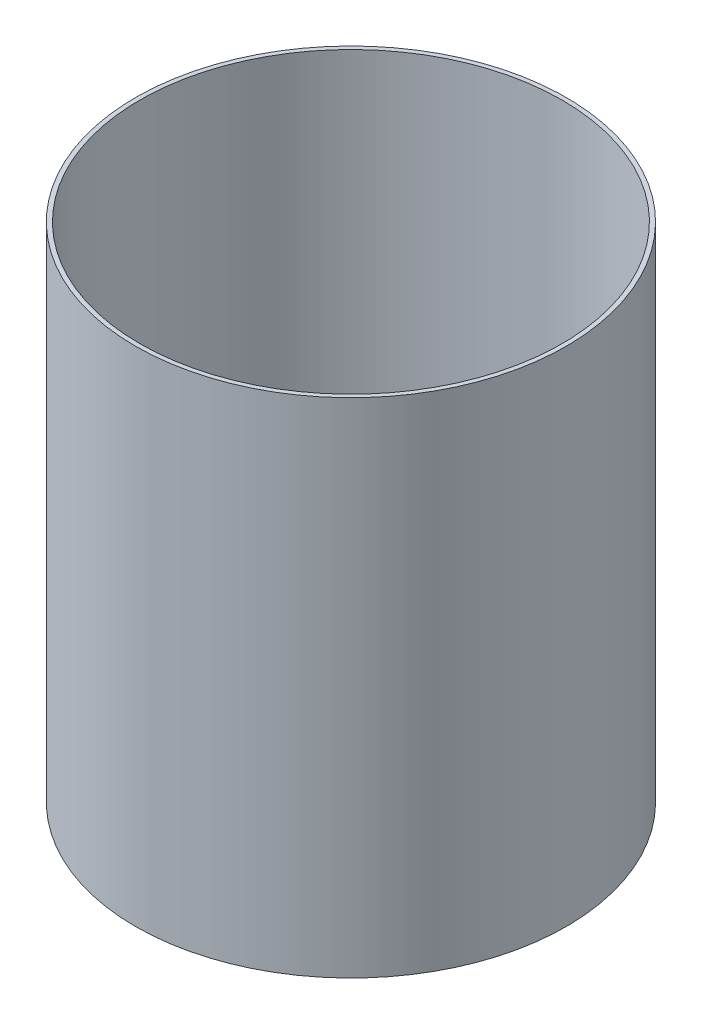
ISO-10303-21;
HEADER;
FILE_DESCRIPTION(('STEP AP214'),'2;1');
FILE_NAME('part.step','',(''),(''),'','','');
FILE_SCHEMA(('AUTOMOTIVE_DESIGN { 1 0 10303 214 1 1 1 1 }'));
ENDSEC;
DATA;
#1=APPLICATION_CONTEXT('core data for automotive mechanical design processes');
#2=APPLICATION_PROTOCOL_DEFINITION('international standard','automotive_design',2000,#1);
#3=PRODUCT_CONTEXT('',#1,'mechanical');
#4=PRODUCT('Part','Part','',(#3));
#5=PRODUCT_RELATED_PRODUCT_CATEGORY('part','',(#4));
#6=PRODUCT_DEFINITION_FORMATION('','',#4);
#7=PRODUCT_DEFINITION_CONTEXT('part definition',#1,'design');
#8=PRODUCT_DEFINITION('design','',#6,#7);
#9=PRODUCT_DEFINITION_SHAPE('','',#8);
#10=(LENGTH_UNIT() NAMED_UNIT(*) SI_UNIT(.MILLI.,.METRE.));
#11=(NAMED_UNIT(*) PLANE_ANGLE_UNIT() SI_UNIT($,.RADIAN.));
#12=(NAMED_UNIT(*) SI_UNIT($,.STERADIAN.) SOLID_ANGLE_UNIT());
#13=UNCERTAINTY_MEASURE_WITH_UNIT(LENGTH_MEASURE(1.E-05),#10,'distance_accuracy_value','');
#14=(GEOMETRIC_REPRESENTATION_CONTEXT(3) GLOBAL_UNCERTAINTY_ASSIGNED_CONTEXT((#13)) GLOBAL_UNIT_ASSIGNED_CONTEXT((#10,
#11,#12)) REPRESENTATION_CONTEXT('',''));
#15=CARTESIAN_POINT('',(0.,0.,0.));
#16=DIRECTION('',(0.,0.,1.));
#17=DIRECTION('',(1.,0.,0.));
#18=AXIS2_PLACEMENT_3D('',#15,#16,#17);
#19=CARTESIAN_POINT('',(0.,64.0981884057971,0.));
#20=DIRECTION('',(0.,1.,0.));
#21=DIRECTION('',(0.,0.,1.));
#22=AXIS2_PLACEMENT_3D('',#19,#20,#21);
#23=CYLINDRICAL_SURFACE('',#22,76.2);
#24=CARTESIAN_POINT('',(0.,-113.701811594203,0.));
#25=DIRECTION('',(0.,1.,0.));
#26=DIRECTION('',(0.,0.,1.));
#27=AXIS2_PLACEMENT_3D('',#24,#25,#26);
#28=CIRCLE('',#27,76.2);
#29=CARTESIAN_POINT('',(0.,-113.701811594203,76.2));
#30=VERTEX_POINT('',#29);
#31=EDGE_CURVE('E10',#30,#30,#28,.T.);
#32=ORIENTED_EDGE('',*,*,#31,.T.);
#33=EDGE_LOOP('',(#32));
#34=FACE_BOUND('',#33,.T.);
#35=CARTESIAN_POINT('',(0.,64.0981884057971,0.));
#36=DIRECTION('',(0.,1.,0.));
#37=DIRECTION('',(0.,0.,1.));
#38=AXIS2_PLACEMENT_3D('',#35,#36,#37);
#39=CIRCLE('',#38,76.2);
#40=CARTESIAN_POINT('',(0.,64.0981884057971,76.2));
#41=VERTEX_POINT('',#40);
#42=EDGE_CURVE('E45',#41,#41,#39,.T.);
#43=ORIENTED_EDGE('',*,*,#42,.F.);
#44=EDGE_LOOP('',(#43));
#45=FACE_BOUND('',#44,.T.);
#46=ADVANCED_FACE('F31',(#34,#45),#23,.T.);
#47=CARTESIAN_POINT('',(-76.2,-113.701811594203,0.));
#48=DIRECTION('',(0.,-1.,0.));
#49=DIRECTION('',(0.,0.,-1.));
#50=AXIS2_PLACEMENT_3D('',#47,#48,#49);
#51=PLANE('',#50);
#52=CARTESIAN_POINT('',(0.,-113.701811594203,0.));
#53=DIRECTION('',(0.,1.,0.));
#54=DIRECTION('',(0.,0.,1.));
#55=AXIS2_PLACEMENT_3D('',#52,#53,#54);
#56=CIRCLE('',#55,74.676);
#57=CARTESIAN_POINT('',(0.,-113.701811594203,74.676));
#58=VERTEX_POINT('',#57);
#59=EDGE_CURVE('E37',#58,#58,#56,.T.);
#60=ORIENTED_EDGE('',*,*,#59,.T.);
#61=EDGE_LOOP('',(#60));
#62=FACE_BOUND('',#61,.T.);
#63=ORIENTED_EDGE('',*,*,#31,.F.);
#64=EDGE_LOOP('',(#63));
#65=FACE_BOUND('',#64,.T.);
#66=ADVANCED_FACE('F55',(#62,#65),#51,.T.);
#67=CARTESIAN_POINT('',(0.,64.0981884057971,0.));
#68=DIRECTION('',(0.,1.,0.));
#69=DIRECTION('',(0.,0.,1.));
#70=AXIS2_PLACEMENT_3D('',#67,#68,#69);
#71=CYLINDRICAL_SURFACE('',#70,74.676);
#72=CARTESIAN_POINT('',(0.,64.0981884057971,0.));
#73=DIRECTION('',(0.,1.,0.));
#74=DIRECTION('',(0.,0.,1.));
#75=AXIS2_PLACEMENT_3D('',#72,#73,#74);
#76=CIRCLE('',#75,74.676);
#77=CARTESIAN_POINT('',(0.,64.0981884057971,74.676));
#78=VERTEX_POINT('',#77);
#79=EDGE_CURVE('E41',#78,#78,#76,.T.);
#80=ORIENTED_EDGE('',*,*,#79,.T.);
#81=EDGE_LOOP('',(#80));
#82=FACE_BOUND('',#81,.T.);
#83=ORIENTED_EDGE('',*,*,#59,.F.);
#84=EDGE_LOOP('',(#83));
#85=FACE_BOUND('',#84,.T.);
#86=ADVANCED_FACE('F59',(#82,#85),#71,.F.);
#87=CARTESIAN_POINT('',(-76.2,64.0981884057971,0.));
#88=DIRECTION('',(0.,1.,0.));
#89=DIRECTION('',(0.,0.,1.));
#90=AXIS2_PLACEMENT_3D('',#87,#88,#89);
#91=PLANE('',#90);
#92=ORIENTED_EDGE('',*,*,#42,.T.);
#93=EDGE_LOOP('',(#92));
#94=FACE_BOUND('',#93,.T.);
#95=ORIENTED_EDGE('',*,*,#79,.F.);
#96=EDGE_LOOP('',(#95));
#97=FACE_BOUND('',#96,.T.);
#98=ADVANCED_FACE('F51',(#94,#97),#91,.T.);
#99=CLOSED_SHELL('',(#46,#66,#86,#98));
#100=MANIFOLD_SOLID_BREP('B2',#99);
#101=ADVANCED_BREP_SHAPE_REPRESENTATION('',(#18,#100),#14);
#102=SHAPE_DEFINITION_REPRESENTATION(#9,#101);
ENDSEC;
END-ISO-10303-21;
